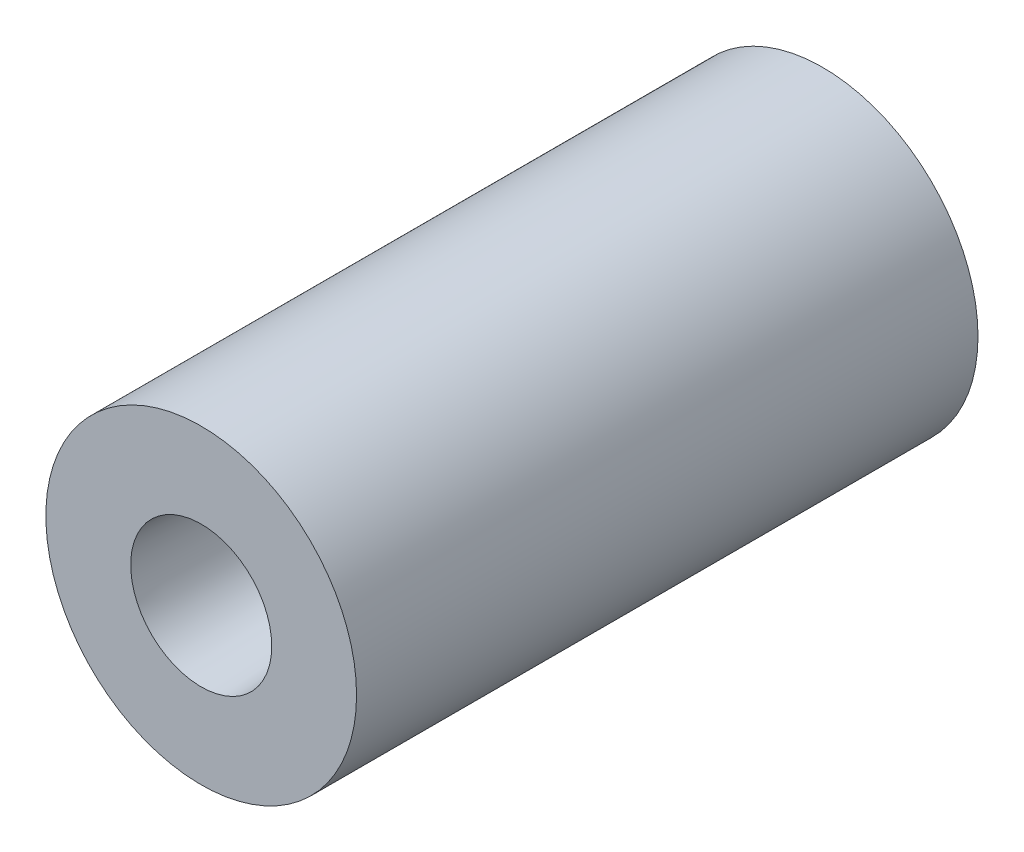
ISO-10303-21;
HEADER;
FILE_DESCRIPTION(('STEP AP214'),'2;1');
FILE_NAME('part.step','',(''),(''),'','','');
FILE_SCHEMA(('AUTOMOTIVE_DESIGN { 1 0 10303 214 1 1 1 1 }'));
ENDSEC;
DATA;
#1=APPLICATION_CONTEXT('core data for automotive mechanical design processes');
#2=APPLICATION_PROTOCOL_DEFINITION('international standard','automotive_design',2000,#1);
#3=PRODUCT_CONTEXT('',#1,'mechanical');
#4=PRODUCT('Part','Part','',(#3));
#5=PRODUCT_RELATED_PRODUCT_CATEGORY('part','',(#4));
#6=PRODUCT_DEFINITION_FORMATION('','',#4);
#7=PRODUCT_DEFINITION_CONTEXT('part definition',#1,'design');
#8=PRODUCT_DEFINITION('design','',#6,#7);
#9=PRODUCT_DEFINITION_SHAPE('','',#8);
#10=(LENGTH_UNIT() NAMED_UNIT(*) SI_UNIT(.MILLI.,.METRE.));
#11=(NAMED_UNIT(*) PLANE_ANGLE_UNIT() SI_UNIT($,.RADIAN.));
#12=(NAMED_UNIT(*) SI_UNIT($,.STERADIAN.) SOLID_ANGLE_UNIT());
#13=UNCERTAINTY_MEASURE_WITH_UNIT(LENGTH_MEASURE(1.E-05),#10,'distance_accuracy_value','');
#14=(GEOMETRIC_REPRESENTATION_CONTEXT(3) GLOBAL_UNCERTAINTY_ASSIGNED_CONTEXT((#13)) GLOBAL_UNIT_ASSIGNED_CONTEXT((#10,
#11,#12)) REPRESENTATION_CONTEXT('',''));
#15=CARTESIAN_POINT('',(0.,0.,0.));
#16=DIRECTION('',(0.,0.,1.));
#17=DIRECTION('',(1.,0.,0.));
#18=AXIS2_PLACEMENT_3D('',#15,#16,#17);
#19=CARTESIAN_POINT('',(0.,0.,20.));
#20=DIRECTION('',(0.,0.,-1.));
#21=DIRECTION('',(-1.,0.,0.));
#22=AXIS2_PLACEMENT_3D('',#19,#20,#21);
#23=CYLINDRICAL_SURFACE('',#22,1.);
#24=CARTESIAN_POINT('',(0.,0.,5.68));
#25=DIRECTION('',(0.,0.,1.));
#26=DIRECTION('',(1.,0.,0.));
#27=AXIS2_PLACEMENT_3D('',#24,#25,#26);
#28=CIRCLE('',#27,1.);
#29=CARTESIAN_POINT('',(1.,0.,5.68));
#30=VERTEX_POINT('',#29);
#31=EDGE_CURVE('E52',#30,#30,#28,.F.);
#32=ORIENTED_EDGE('',*,*,#31,.T.);
#33=EDGE_LOOP('',(#32));
#34=FACE_BOUND('',#33,.T.);
#35=CARTESIAN_POINT('',(0.,0.,14.32));
#36=DIRECTION('',(0.,0.,1.));
#37=DIRECTION('',(1.,0.,0.));
#38=AXIS2_PLACEMENT_3D('',#35,#36,#37);
#39=CIRCLE('',#38,1.);
#40=CARTESIAN_POINT('',(1.,0.,14.32));
#41=VERTEX_POINT('',#40);
#42=EDGE_CURVE('E39',#41,#41,#39,.T.);
#43=ORIENTED_EDGE('',*,*,#42,.T.);
#44=EDGE_LOOP('',(#43));
#45=FACE_BOUND('',#44,.T.);
#46=ADVANCED_FACE('F35',(#34,#45),#23,.F.);
#47=CARTESIAN_POINT('',(0.,0.,20.));
#48=DIRECTION('',(0.,0.,-1.));
#49=DIRECTION('',(-1.,0.,0.));
#50=AXIS2_PLACEMENT_3D('',#47,#48,#49);
#51=CYLINDRICAL_SURFACE('',#50,5.);
#52=CARTESIAN_POINT('',(0.,0.,20.));
#53=DIRECTION('',(0.,0.,1.));
#54=DIRECTION('',(1.,0.,0.));
#55=AXIS2_PLACEMENT_3D('',#52,#53,#54);
#56=CIRCLE('',#55,5.);
#57=CARTESIAN_POINT('',(5.,0.,20.));
#58=VERTEX_POINT('',#57);
#59=EDGE_CURVE('E10',#58,#58,#56,.T.);
#60=ORIENTED_EDGE('',*,*,#59,.F.);
#61=EDGE_LOOP('',(#60));
#62=FACE_BOUND('',#61,.T.);
#63=CARTESIAN_POINT('',(0.,0.,0.));
#64=DIRECTION('',(0.,0.,1.));
#65=DIRECTION('',(1.,0.,0.));
#66=AXIS2_PLACEMENT_3D('',#63,#64,#65);
#67=CIRCLE('',#66,5.);
#68=CARTESIAN_POINT('',(5.,0.,0.));
#69=VERTEX_POINT('',#68);
#70=EDGE_CURVE('E43',#69,#69,#67,.T.);
#71=ORIENTED_EDGE('',*,*,#70,.T.);
#72=EDGE_LOOP('',(#71));
#73=FACE_BOUND('',#72,.T.);
#74=ADVANCED_FACE('F37',(#62,#73),#51,.T.);
#75=CARTESIAN_POINT('',(0.,0.,20.));
#76=DIRECTION('',(0.,0.,1.));
#77=DIRECTION('',(1.,0.,0.));
#78=AXIS2_PLACEMENT_3D('',#75,#76,#77);
#79=PLANE('',#78);
#80=CARTESIAN_POINT('',(0.,0.,20.));
#81=DIRECTION('',(0.,0.,1.));
#82=DIRECTION('',(1.,0.,0.));
#83=AXIS2_PLACEMENT_3D('',#80,#81,#82);
#84=CIRCLE('',#83,2.27);
#85=CARTESIAN_POINT('',(2.27,0.,20.));
#86=VERTEX_POINT('',#85);
#87=EDGE_CURVE('E63',#86,#86,#84,.T.);
#88=ORIENTED_EDGE('',*,*,#87,.F.);
#89=EDGE_LOOP('',(#88));
#90=FACE_BOUND('',#89,.T.);
#91=ORIENTED_EDGE('',*,*,#59,.T.);
#92=EDGE_LOOP('',(#91));
#93=FACE_BOUND('',#92,.T.);
#94=ADVANCED_FACE('F73',(#90,#93),#79,.T.);
#95=CARTESIAN_POINT('',(0.,0.,0.));
#96=DIRECTION('',(0.,0.,1.));
#97=DIRECTION('',(1.,0.,0.));
#98=AXIS2_PLACEMENT_3D('',#95,#96,#97);
#99=PLANE('',#98);
#100=CARTESIAN_POINT('',(0.,0.,0.));
#101=DIRECTION('',(0.,0.,1.));
#102=DIRECTION('',(1.,0.,0.));
#103=AXIS2_PLACEMENT_3D('',#100,#101,#102);
#104=CIRCLE('',#103,2.27);
#105=CARTESIAN_POINT('',(2.27,0.,0.));
#106=VERTEX_POINT('',#105);
#107=EDGE_CURVE('E54',#106,#106,#104,.T.);
#108=ORIENTED_EDGE('',*,*,#107,.T.);
#109=EDGE_LOOP('',(#108));
#110=FACE_BOUND('',#109,.T.);
#111=ORIENTED_EDGE('',*,*,#70,.F.);
#112=EDGE_LOOP('',(#111));
#113=FACE_BOUND('',#112,.T.);
#114=ADVANCED_FACE('F75',(#110,#113),#99,.F.);
#115=CARTESIAN_POINT('',(0.,0.,0.));
#116=DIRECTION('',(0.,0.,-1.));
#117=DIRECTION('',(1.,0.,0.));
#118=AXIS2_PLACEMENT_3D('',#115,#116,#117);
#119=CONICAL_SURFACE('',#118,2.27,0.0536514212063058);
#120=CARTESIAN_POINT('',(0.,0.,5.68));
#121=DIRECTION('',(0.,0.,1.));
#122=DIRECTION('',(1.,0.,0.));
#123=AXIS2_PLACEMENT_3D('',#120,#121,#122);
#124=CIRCLE('',#123,1.9649671949344);
#125=CARTESIAN_POINT('',(1.9649671949344,0.,5.68));
#126=VERTEX_POINT('',#125);
#127=EDGE_CURVE('E48',#126,#126,#124,.T.);
#128=ORIENTED_EDGE('',*,*,#127,.T.);
#129=EDGE_LOOP('',(#128));
#130=FACE_BOUND('',#129,.T.);
#131=ORIENTED_EDGE('',*,*,#107,.F.);
#132=EDGE_LOOP('',(#131));
#133=FACE_BOUND('',#132,.T.);
#134=ADVANCED_FACE('F81',(#130,#133),#119,.F.);
#135=CARTESIAN_POINT('',(0.,0.,5.68));
#136=DIRECTION('',(0.,0.,1.));
#137=DIRECTION('',(1.,0.,0.));
#138=AXIS2_PLACEMENT_3D('',#135,#136,#137);
#139=PLANE('',#138);
#140=ORIENTED_EDGE('',*,*,#31,.F.);
#141=EDGE_LOOP('',(#140));
#142=FACE_BOUND('',#141,.T.);
#143=ORIENTED_EDGE('',*,*,#127,.F.);
#144=EDGE_LOOP('',(#143));
#145=FACE_BOUND('',#144,.T.);
#146=ADVANCED_FACE('F92',(#142,#145),#139,.F.);
#147=CARTESIAN_POINT('',(0.,0.,20.));
#148=DIRECTION('',(0.,0.,1.));
#149=DIRECTION('',(1.,0.,0.));
#150=AXIS2_PLACEMENT_3D('',#147,#148,#149);
#151=CONICAL_SURFACE('',#150,2.27,0.0536514212063058);
#152=CARTESIAN_POINT('',(0.,0.,14.32));
#153=DIRECTION('',(0.,0.,1.));
#154=DIRECTION('',(1.,0.,0.));
#155=AXIS2_PLACEMENT_3D('',#152,#153,#154);
#156=CIRCLE('',#155,1.9649671949344);
#157=CARTESIAN_POINT('',(1.9649671949344,0.,14.32));
#158=VERTEX_POINT('',#157);
#159=EDGE_CURVE('E59',#158,#158,#156,.T.);
#160=ORIENTED_EDGE('',*,*,#159,.F.);
#161=EDGE_LOOP('',(#160));
#162=FACE_BOUND('',#161,.T.);
#163=ORIENTED_EDGE('',*,*,#87,.T.);
#164=EDGE_LOOP('',(#163));
#165=FACE_BOUND('',#164,.T.);
#166=ADVANCED_FACE('F71',(#162,#165),#151,.F.);
#167=CARTESIAN_POINT('',(0.,0.,14.32));
#168=DIRECTION('',(0.,0.,1.));
#169=DIRECTION('',(1.,0.,0.));
#170=AXIS2_PLACEMENT_3D('',#167,#168,#169);
#171=PLANE('',#170);
#172=ORIENTED_EDGE('',*,*,#42,.F.);
#173=EDGE_LOOP('',(#172));
#174=FACE_BOUND('',#173,.T.);
#175=ORIENTED_EDGE('',*,*,#159,.T.);
#176=EDGE_LOOP('',(#175));
#177=FACE_BOUND('',#176,.T.);
#178=ADVANCED_FACE('F119',(#174,#177),#171,.T.);
#179=CLOSED_SHELL('',(#46,#74,#94,#114,#134,#146,#166,#178));
#180=MANIFOLD_SOLID_BREP('B2',#179);
#181=ADVANCED_BREP_SHAPE_REPRESENTATION('',(#18,#180),#14);
#182=SHAPE_DEFINITION_REPRESENTATION(#9,#181);
ENDSEC;
END-ISO-10303-21;
